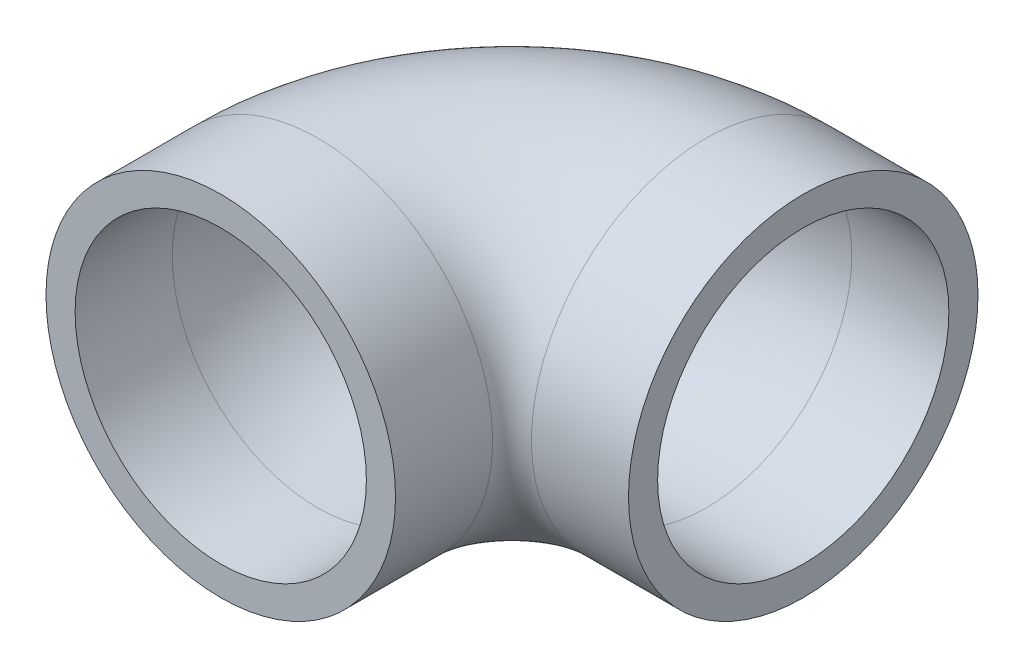
ISO-10303-21;
HEADER;
FILE_DESCRIPTION(('STEP AP214'),'2;1');
FILE_NAME('part.step','',(''),(''),'','','');
FILE_SCHEMA(('AUTOMOTIVE_DESIGN { 1 0 10303 214 1 1 1 1 }'));
ENDSEC;
DATA;
#1=APPLICATION_CONTEXT('core data for automotive mechanical design processes');
#2=APPLICATION_PROTOCOL_DEFINITION('international standard','automotive_design',2000,#1);
#3=PRODUCT_CONTEXT('',#1,'mechanical');
#4=PRODUCT('Part','Part','',(#3));
#5=PRODUCT_RELATED_PRODUCT_CATEGORY('part','',(#4));
#6=PRODUCT_DEFINITION_FORMATION('','',#4);
#7=PRODUCT_DEFINITION_CONTEXT('part definition',#1,'design');
#8=PRODUCT_DEFINITION('design','',#6,#7);
#9=PRODUCT_DEFINITION_SHAPE('','',#8);
#10=(LENGTH_UNIT() NAMED_UNIT(*) SI_UNIT(.MILLI.,.METRE.));
#11=(NAMED_UNIT(*) PLANE_ANGLE_UNIT() SI_UNIT($,.RADIAN.));
#12=(NAMED_UNIT(*) SI_UNIT($,.STERADIAN.) SOLID_ANGLE_UNIT());
#13=UNCERTAINTY_MEASURE_WITH_UNIT(LENGTH_MEASURE(1.E-05),#10,'distance_accuracy_value','');
#14=(GEOMETRIC_REPRESENTATION_CONTEXT(3) GLOBAL_UNCERTAINTY_ASSIGNED_CONTEXT((#13)) GLOBAL_UNIT_ASSIGNED_CONTEXT((#10,
#11,#12)) REPRESENTATION_CONTEXT('',''));
#15=CARTESIAN_POINT('',(0.,0.,0.));
#16=DIRECTION('',(0.,0.,1.));
#17=DIRECTION('',(1.,0.,0.));
#18=AXIS2_PLACEMENT_3D('',#15,#16,#17);
#19=CARTESIAN_POINT('',(0.,0.,0.));
#20=DIRECTION('',(0.,0.,-1.));
#21=DIRECTION('',(-1.,0.,0.));
#22=AXIS2_PLACEMENT_3D('',#19,#20,#21);
#23=CYLINDRICAL_SURFACE('',#22,22.86);
#24=CARTESIAN_POINT('',(0.,0.,-12.7));
#25=DIRECTION('',(0.,0.,1.));
#26=DIRECTION('',(1.,0.,0.));
#27=AXIS2_PLACEMENT_3D('',#24,#25,#26);
#28=CIRCLE('',#27,22.86);
#29=CARTESIAN_POINT('',(-22.86,0.,-12.7));
#30=VERTEX_POINT('',#29);
#31=EDGE_CURVE('E101',#30,#30,#28,.T.);
#32=ORIENTED_EDGE('',*,*,#31,.T.);
#33=EDGE_LOOP('',(#32));
#34=FACE_BOUND('',#33,.T.);
#35=CARTESIAN_POINT('',(0.,0.,0.));
#36=DIRECTION('',(0.,0.,1.));
#37=DIRECTION('',(1.,0.,0.));
#38=AXIS2_PLACEMENT_3D('',#35,#36,#37);
#39=CIRCLE('',#38,22.86);
#40=CARTESIAN_POINT('',(22.86,0.,0.));
#41=VERTEX_POINT('',#40);
#42=EDGE_CURVE('E50',#41,#41,#39,.T.);
#43=ORIENTED_EDGE('',*,*,#42,.F.);
#44=EDGE_LOOP('',(#43));
#45=FACE_BOUND('',#44,.T.);
#46=ADVANCED_FACE('F35',(#34,#45),#23,.T.);
#47=CARTESIAN_POINT('',(25.4,0.,-12.7));
#48=DIRECTION('',(0.,-1.,0.));
#49=DIRECTION('',(0.,0.,-1.));
#50=AXIS2_PLACEMENT_3D('',#47,#48,#49);
#51=TOROIDAL_SURFACE('',#50,25.4,22.86);
#52=CARTESIAN_POINT('',(25.4,0.,-38.1));
#53=DIRECTION('',(-1.,0.,0.));
#54=DIRECTION('',(0.,0.,1.));
#55=AXIS2_PLACEMENT_3D('',#52,#53,#54);
#56=CIRCLE('',#55,22.86);
#57=CARTESIAN_POINT('',(25.4,0.,-60.96));
#58=VERTEX_POINT('',#57);
#59=EDGE_CURVE('E39',#58,#58,#56,.T.);
#60=CARTESIAN_POINT('',(25.4,0.,-12.7));
#61=DIRECTION('',(0.,-1.,0.));
#62=DIRECTION('',(0.,0.,-1.));
#63=AXIS2_PLACEMENT_3D('',#60,#61,#62);
#64=CIRCLE('',#63,48.26);
#65=EDGE_CURVE('',#30,#58,#64,.T.);
#66=ORIENTED_EDGE('',*,*,#31,.F.);
#67=ORIENTED_EDGE('',*,*,#59,.T.);
#68=ORIENTED_EDGE('',*,*,#65,.T.);
#69=ORIENTED_EDGE('',*,*,#65,.F.);
#70=EDGE_LOOP('',(#66,#68,#67,#69));
#71=FACE_BOUND('',#70,.T.);
#72=ADVANCED_FACE('F108',(#71),#51,.T.);
#73=CARTESIAN_POINT('',(25.4,0.,-38.1));
#74=DIRECTION('',(1.,0.,0.));
#75=DIRECTION('',(0.,0.,-1.));
#76=AXIS2_PLACEMENT_3D('',#73,#74,#75);
#77=CYLINDRICAL_SURFACE('',#76,22.86);
#78=CARTESIAN_POINT('',(38.1,0.,-38.1));
#79=DIRECTION('',(-1.,0.,0.));
#80=DIRECTION('',(0.,0.,1.));
#81=AXIS2_PLACEMENT_3D('',#78,#79,#80);
#82=CIRCLE('',#81,22.86);
#83=CARTESIAN_POINT('',(38.1,0.,-15.24));
#84=VERTEX_POINT('',#83);
#85=EDGE_CURVE('E55',#84,#84,#82,.T.);
#86=ORIENTED_EDGE('',*,*,#85,.T.);
#87=EDGE_LOOP('',(#86));
#88=FACE_BOUND('',#87,.T.);
#89=ORIENTED_EDGE('',*,*,#59,.F.);
#90=EDGE_LOOP('',(#89));
#91=FACE_BOUND('',#90,.T.);
#92=ADVANCED_FACE('F37',(#88,#91),#77,.T.);
#93=CARTESIAN_POINT('',(0.,0.,0.));
#94=DIRECTION('',(0.,0.,1.));
#95=DIRECTION('',(1.,0.,0.));
#96=AXIS2_PLACEMENT_3D('',#93,#94,#95);
#97=PLANE('',#96);
#98=CARTESIAN_POINT('',(0.,0.,0.));
#99=DIRECTION('',(0.,0.,1.));
#100=DIRECTION('',(1.,0.,0.));
#101=AXIS2_PLACEMENT_3D('',#98,#99,#100);
#102=CIRCLE('',#101,19.05);
#103=CARTESIAN_POINT('',(19.05,0.,0.));
#104=VERTEX_POINT('',#103);
#105=EDGE_CURVE('E94',#104,#104,#102,.F.);
#106=ORIENTED_EDGE('',*,*,#105,.T.);
#107=EDGE_LOOP('',(#106));
#108=FACE_BOUND('',#107,.T.);
#109=ORIENTED_EDGE('',*,*,#42,.T.);
#110=EDGE_LOOP('',(#109));
#111=FACE_BOUND('',#110,.T.);
#112=ADVANCED_FACE('F68',(#108,#111),#97,.T.);
#113=CARTESIAN_POINT('',(38.1,0.,-38.1));
#114=DIRECTION('',(-1.,0.,0.));
#115=DIRECTION('',(0.,0.,1.));
#116=AXIS2_PLACEMENT_3D('',#113,#114,#115);
#117=PLANE('',#116);
#118=CARTESIAN_POINT('',(38.1,0.,-38.1));
#119=DIRECTION('',(-1.,0.,0.));
#120=DIRECTION('',(0.,0.,1.));
#121=AXIS2_PLACEMENT_3D('',#118,#119,#120);
#122=CIRCLE('',#121,19.05);
#123=CARTESIAN_POINT('',(38.1,0.,-19.05));
#124=VERTEX_POINT('',#123);
#125=EDGE_CURVE('E11',#124,#124,#122,.F.);
#126=ORIENTED_EDGE('',*,*,#125,.F.);
#127=EDGE_LOOP('',(#126));
#128=FACE_BOUND('',#127,.T.);
#129=ORIENTED_EDGE('',*,*,#85,.F.);
#130=EDGE_LOOP('',(#129));
#131=FACE_BOUND('',#130,.T.);
#132=ADVANCED_FACE('F65',(#128,#131),#117,.F.);
#133=CARTESIAN_POINT('',(0.,0.,0.));
#134=DIRECTION('',(0.,0.,-1.));
#135=DIRECTION('',(-1.,0.,0.));
#136=AXIS2_PLACEMENT_3D('',#133,#134,#135);
#137=CYLINDRICAL_SURFACE('',#136,19.05);
#138=CARTESIAN_POINT('',(0.,0.,-12.7));
#139=DIRECTION('',(0.,0.,1.));
#140=DIRECTION('',(1.,0.,0.));
#141=AXIS2_PLACEMENT_3D('',#138,#139,#140);
#142=CIRCLE('',#141,19.05);
#143=CARTESIAN_POINT('',(-19.05,0.,-12.7));
#144=VERTEX_POINT('',#143);
#145=EDGE_CURVE('E93',#144,#144,#142,.F.);
#146=ORIENTED_EDGE('',*,*,#145,.T.);
#147=EDGE_LOOP('',(#146));
#148=FACE_BOUND('',#147,.T.);
#149=ORIENTED_EDGE('',*,*,#105,.F.);
#150=EDGE_LOOP('',(#149));
#151=FACE_BOUND('',#150,.T.);
#152=ADVANCED_FACE('F67',(#148,#151),#137,.F.);
#153=CARTESIAN_POINT('',(25.4,0.,-12.7));
#154=DIRECTION('',(0.,-1.,0.));
#155=DIRECTION('',(0.,0.,-1.));
#156=AXIS2_PLACEMENT_3D('',#153,#154,#155);
#157=TOROIDAL_SURFACE('',#156,25.4,19.05);
#158=CARTESIAN_POINT('',(25.4,0.,-38.1));
#159=DIRECTION('',(-1.,0.,0.));
#160=DIRECTION('',(0.,0.,1.));
#161=AXIS2_PLACEMENT_3D('',#158,#159,#160);
#162=CIRCLE('',#161,19.05);
#163=CARTESIAN_POINT('',(25.4,0.,-57.15));
#164=VERTEX_POINT('',#163);
#165=EDGE_CURVE('E44',#164,#164,#162,.F.);
#166=CARTESIAN_POINT('',(25.4,0.,-12.7));
#167=DIRECTION('',(0.,-1.,0.));
#168=DIRECTION('',(0.,0.,-1.));
#169=AXIS2_PLACEMENT_3D('',#166,#167,#168);
#170=CIRCLE('',#169,44.45);
#171=EDGE_CURVE('',#144,#164,#170,.T.);
#172=ORIENTED_EDGE('',*,*,#145,.F.);
#173=ORIENTED_EDGE('',*,*,#165,.T.);
#174=ORIENTED_EDGE('',*,*,#171,.T.);
#175=ORIENTED_EDGE('',*,*,#171,.F.);
#176=EDGE_LOOP('',(#172,#174,#173,#175));
#177=FACE_BOUND('',#176,.T.);
#178=ADVANCED_FACE('F74',(#177),#157,.F.);
#179=CARTESIAN_POINT('',(25.4,0.,-38.1));
#180=DIRECTION('',(1.,0.,0.));
#181=DIRECTION('',(0.,0.,-1.));
#182=AXIS2_PLACEMENT_3D('',#179,#180,#181);
#183=CYLINDRICAL_SURFACE('',#182,19.05);
#184=ORIENTED_EDGE('',*,*,#125,.T.);
#185=EDGE_LOOP('',(#184));
#186=FACE_BOUND('',#185,.T.);
#187=ORIENTED_EDGE('',*,*,#165,.F.);
#188=EDGE_LOOP('',(#187));
#189=FACE_BOUND('',#188,.T.);
#190=ADVANCED_FACE('F62',(#186,#189),#183,.F.);
#191=CLOSED_SHELL('',(#46,#72,#92,#112,#132,#152,#178,#190));
#192=MANIFOLD_SOLID_BREP('B2',#191);
#193=ADVANCED_BREP_SHAPE_REPRESENTATION('',(#18,#192),#14);
#194=SHAPE_DEFINITION_REPRESENTATION(#9,#193);
ENDSEC;
END-ISO-10303-21;
